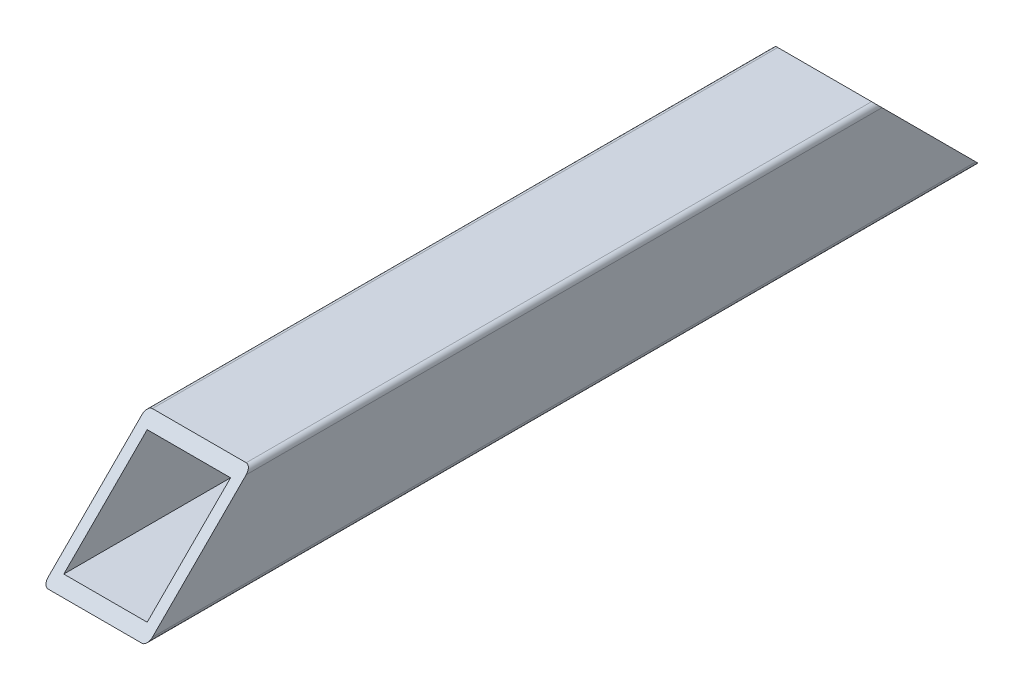
ISO-10303-21;
HEADER;
FILE_DESCRIPTION(('STEP AP214'),'2;1');
FILE_NAME('part.step','',(''),(''),'','','');
FILE_SCHEMA(('AUTOMOTIVE_DESIGN { 1 0 10303 214 1 1 1 1 }'));
ENDSEC;
DATA;
#1=APPLICATION_CONTEXT('core data for automotive mechanical design processes');
#2=APPLICATION_PROTOCOL_DEFINITION('international standard','automotive_design',2000,#1);
#3=PRODUCT_CONTEXT('',#1,'mechanical');
#4=PRODUCT('Part','Part','',(#3));
#5=PRODUCT_RELATED_PRODUCT_CATEGORY('part','',(#4));
#6=PRODUCT_DEFINITION_FORMATION('','',#4);
#7=PRODUCT_DEFINITION_CONTEXT('part definition',#1,'design');
#8=PRODUCT_DEFINITION('design','',#6,#7);
#9=PRODUCT_DEFINITION_SHAPE('','',#8);
#10=(LENGTH_UNIT() NAMED_UNIT(*) SI_UNIT(.MILLI.,.METRE.));
#11=(NAMED_UNIT(*) PLANE_ANGLE_UNIT() SI_UNIT($,.RADIAN.));
#12=(NAMED_UNIT(*) SI_UNIT($,.STERADIAN.) SOLID_ANGLE_UNIT());
#13=UNCERTAINTY_MEASURE_WITH_UNIT(LENGTH_MEASURE(1.E-05),#10,'distance_accuracy_value','');
#14=(GEOMETRIC_REPRESENTATION_CONTEXT(3) GLOBAL_UNCERTAINTY_ASSIGNED_CONTEXT((#13)) GLOBAL_UNIT_ASSIGNED_CONTEXT((#10,
#11,#12)) REPRESENTATION_CONTEXT('',''));
#15=CARTESIAN_POINT('',(0.,0.,0.));
#16=DIRECTION('',(0.,0.,1.));
#17=DIRECTION('',(1.,0.,0.));
#18=AXIS2_PLACEMENT_3D('',#15,#16,#17);
#19=CARTESIAN_POINT('',(-5.,-4.50000000000001,-80.));
#20=DIRECTION('',(1.,0.,0.));
#21=DIRECTION('',(0.,0.,-1.));
#22=AXIS2_PLACEMENT_3D('',#19,#20,#21);
#23=PLANE('',#22);
#24=DIRECTION('',(0.,0.,1.));
#25=VECTOR('',#24,1.);
#26=CARTESIAN_POINT('',(-5.,-4.50000000000001,-80.));
#27=LINE('',#26,#25);
#28=CARTESIAN_POINT('',(-5.,-4.50000000000001,-79.5));
#29=VERTEX_POINT('',#28);
#30=CARTESIAN_POINT('',(-5.,-4.5,-0.500000000000007));
#31=VERTEX_POINT('',#30);
#32=EDGE_CURVE('E212',#29,#31,#27,.T.);
#33=ORIENTED_EDGE('',*,*,#32,.T.);
#34=DIRECTION('',(0.,0.707106781186548,-0.707106781186547));
#35=VECTOR('',#34,1.);
#36=CARTESIAN_POINT('',(-5.,5.00000000000002,-10.));
#37=LINE('',#36,#35);
#38=CARTESIAN_POINT('',(-5.,4.50000000000001,-9.50000000000002));
#39=VERTEX_POINT('',#38);
#40=EDGE_CURVE('E179',#31,#39,#37,.T.);
#41=ORIENTED_EDGE('',*,*,#40,.T.);
#42=DIRECTION('',(0.,0.,1.));
#43=VECTOR('',#42,1.);
#44=CARTESIAN_POINT('',(-5.,4.50000000000001,-80.));
#45=LINE('',#44,#43);
#46=CARTESIAN_POINT('',(-5.,4.50000000000001,-70.5));
#47=VERTEX_POINT('',#46);
#48=EDGE_CURVE('E206',#47,#39,#45,.T.);
#49=ORIENTED_EDGE('',*,*,#48,.F.);
#50=DIRECTION('',(0.,-0.707106781186548,-0.707106781186547));
#51=VECTOR('',#50,1.);
#52=CARTESIAN_POINT('',(-5.,5.00000000000002,-70.));
#53=LINE('',#52,#51);
#54=EDGE_CURVE('E262',#47,#29,#53,.T.);
#55=ORIENTED_EDGE('',*,*,#54,.T.);
#56=EDGE_LOOP('',(#33,#41,#49,#55));
#57=FACE_BOUND('',#56,.T.);
#58=ADVANCED_FACE('F67',(#57),#23,.F.);
#59=CARTESIAN_POINT('',(-4.5,-5.00000000000001,-80.));
#60=DIRECTION('',(0.,1.,0.));
#61=DIRECTION('',(-1.,0.,0.));
#62=AXIS2_PLACEMENT_3D('',#59,#60,#61);
#63=PLANE('',#62);
#64=DIRECTION('',(-1.,0.,0.));
#65=VECTOR('',#64,1.);
#66=CARTESIAN_POINT('',(-4.5,-5.00000000000001,0.));
#67=LINE('',#66,#65);
#68=CARTESIAN_POINT('',(4.5,-5.00000000000001,0.));
#69=VERTEX_POINT('',#68);
#70=CARTESIAN_POINT('',(-4.5,-5.00000000000001,0.));
#71=VERTEX_POINT('',#70);
#72=EDGE_CURVE('E163',#69,#71,#67,.T.);
#73=ORIENTED_EDGE('',*,*,#72,.T.);
#74=DIRECTION('',(0.,0.,1.));
#75=VECTOR('',#74,1.);
#76=CARTESIAN_POINT('',(-4.5,-5.00000000000001,-80.));
#77=LINE('',#76,#75);
#78=CARTESIAN_POINT('',(-4.5,-5.00000000000001,-80.));
#79=VERTEX_POINT('',#78);
#80=EDGE_CURVE('E188',#79,#71,#77,.T.);
#81=ORIENTED_EDGE('',*,*,#80,.F.);
#82=DIRECTION('',(-1.,0.,0.));
#83=VECTOR('',#82,1.);
#84=CARTESIAN_POINT('',(-4.5,-5.00000000000001,-80.));
#85=LINE('',#84,#83);
#86=CARTESIAN_POINT('',(4.5,-5.00000000000001,-80.));
#87=VERTEX_POINT('',#86);
#88=EDGE_CURVE('E198',#87,#79,#85,.T.);
#89=ORIENTED_EDGE('',*,*,#88,.F.);
#90=DIRECTION('',(0.,0.,1.));
#91=VECTOR('',#90,1.);
#92=CARTESIAN_POINT('',(4.5,-5.00000000000001,-80.));
#93=LINE('',#92,#91);
#94=EDGE_CURVE('E185',#87,#69,#93,.T.);
#95=ORIENTED_EDGE('',*,*,#94,.T.);
#96=EDGE_LOOP('',(#73,#81,#89,#95));
#97=FACE_BOUND('',#96,.T.);
#98=ADVANCED_FACE('F232',(#97),#63,.F.);
#99=CARTESIAN_POINT('',(-4.5,-4.50000000000001,-80.));
#100=DIRECTION('',(0.,0.,1.));
#101=DIRECTION('',(1.,0.,0.));
#102=AXIS2_PLACEMENT_3D('',#99,#100,#101);
#103=CYLINDRICAL_SURFACE('',#102,0.500000000000002);
#104=ORIENTED_EDGE('',*,*,#80,.T.);
#105=CARTESIAN_POINT('',(-4.5,-4.50000000000001,-0.5));
#106=DIRECTION('',(0.,-0.707106781186547,-0.707106781186548));
#107=DIRECTION('',(0.,-0.707106781186548,0.707106781186547));
#108=AXIS2_PLACEMENT_3D('',#105,#106,#107);
#109=ELLIPSE('',#108,0.70710678118655,0.500000000000002);
#110=EDGE_CURVE('E169',#71,#31,#109,.T.);
#111=ORIENTED_EDGE('',*,*,#110,.T.);
#112=ORIENTED_EDGE('',*,*,#32,.F.);
#113=CARTESIAN_POINT('',(-4.5,-4.50000000000001,-79.5));
#114=DIRECTION('',(0.,-0.707106781186547,0.707106781186548));
#115=DIRECTION('',(0.,0.707106781186548,0.707106781186547));
#116=AXIS2_PLACEMENT_3D('',#113,#114,#115);
#117=ELLIPSE('',#116,0.70710678118655,0.500000000000002);
#118=EDGE_CURVE('E229',#29,#79,#117,.T.);
#119=ORIENTED_EDGE('',*,*,#118,.T.);
#120=EDGE_LOOP('',(#104,#111,#112,#119));
#121=FACE_BOUND('',#120,.T.);
#122=ADVANCED_FACE('F227',(#121),#103,.T.);
#123=CARTESIAN_POINT('',(4.5,-4.50000000000001,-80.));
#124=DIRECTION('',(0.,0.,1.));
#125=DIRECTION('',(1.,0.,0.));
#126=AXIS2_PLACEMENT_3D('',#123,#124,#125);
#127=CYLINDRICAL_SURFACE('',#126,0.500000000000002);
#128=DIRECTION('',(0.,0.,1.));
#129=VECTOR('',#128,1.);
#130=CARTESIAN_POINT('',(5.,-4.50000000000001,-80.));
#131=LINE('',#130,#129);
#132=CARTESIAN_POINT('',(5.,-4.50000000000001,-79.5));
#133=VERTEX_POINT('',#132);
#134=CARTESIAN_POINT('',(5.,-4.50000000000001,-0.500000000000002));
#135=VERTEX_POINT('',#134);
#136=EDGE_CURVE('E176',#133,#135,#131,.T.);
#137=ORIENTED_EDGE('',*,*,#136,.T.);
#138=CARTESIAN_POINT('',(4.5,-4.50000000000001,-0.5));
#139=DIRECTION('',(0.,-0.707106781186547,-0.707106781186548));
#140=DIRECTION('',(0.,-0.707106781186548,0.707106781186547));
#141=AXIS2_PLACEMENT_3D('',#138,#139,#140);
#142=ELLIPSE('',#141,0.70710678118655,0.500000000000002);
#143=EDGE_CURVE('E157',#135,#69,#142,.T.);
#144=ORIENTED_EDGE('',*,*,#143,.T.);
#145=ORIENTED_EDGE('',*,*,#94,.F.);
#146=CARTESIAN_POINT('',(4.5,-4.50000000000001,-79.5));
#147=DIRECTION('',(0.,-0.707106781186547,0.707106781186548));
#148=DIRECTION('',(0.,0.707106781186548,0.707106781186547));
#149=AXIS2_PLACEMENT_3D('',#146,#147,#148);
#150=ELLIPSE('',#149,0.70710678118655,0.500000000000002);
#151=EDGE_CURVE('E184',#87,#133,#150,.T.);
#152=ORIENTED_EDGE('',*,*,#151,.T.);
#153=EDGE_LOOP('',(#137,#144,#145,#152));
#154=FACE_BOUND('',#153,.T.);
#155=ADVANCED_FACE('F183',(#154),#127,.T.);
#156=CARTESIAN_POINT('',(5.,-4.50000000000001,-80.));
#157=DIRECTION('',(-1.,0.,0.));
#158=DIRECTION('',(0.,0.,1.));
#159=AXIS2_PLACEMENT_3D('',#156,#157,#158);
#160=PLANE('',#159);
#161=DIRECTION('',(0.,0.,1.));
#162=VECTOR('',#161,1.);
#163=CARTESIAN_POINT('',(5.,4.50000000000001,-80.));
#164=LINE('',#163,#162);
#165=CARTESIAN_POINT('',(5.,4.50000000000001,-70.5));
#166=VERTEX_POINT('',#165);
#167=CARTESIAN_POINT('',(5.,4.50000000000001,-9.50000000000002));
#168=VERTEX_POINT('',#167);
#169=EDGE_CURVE('E178',#166,#168,#164,.T.);
#170=ORIENTED_EDGE('',*,*,#169,.T.);
#171=DIRECTION('',(0.,0.707106781186548,-0.707106781186547));
#172=VECTOR('',#171,1.);
#173=CARTESIAN_POINT('',(5.,5.00000000000002,-10.));
#174=LINE('',#173,#172);
#175=EDGE_CURVE('E160',#135,#168,#174,.T.);
#176=ORIENTED_EDGE('',*,*,#175,.F.);
#177=ORIENTED_EDGE('',*,*,#136,.F.);
#178=DIRECTION('',(0.,-0.707106781186548,-0.707106781186547));
#179=VECTOR('',#178,1.);
#180=CARTESIAN_POINT('',(5.,5.00000000000002,-70.));
#181=LINE('',#180,#179);
#182=EDGE_CURVE('E263',#166,#133,#181,.T.);
#183=ORIENTED_EDGE('',*,*,#182,.F.);
#184=EDGE_LOOP('',(#170,#176,#177,#183));
#185=FACE_BOUND('',#184,.T.);
#186=ADVANCED_FACE('F174',(#185),#160,.F.);
#187=CARTESIAN_POINT('',(4.5,4.50000000000001,-80.));
#188=DIRECTION('',(0.,0.,1.));
#189=DIRECTION('',(1.,0.,0.));
#190=AXIS2_PLACEMENT_3D('',#187,#188,#189);
#191=CYLINDRICAL_SURFACE('',#190,0.500000000000002);
#192=DIRECTION('',(0.,0.,1.));
#193=VECTOR('',#192,1.);
#194=CARTESIAN_POINT('',(4.5,5.00000000000002,-80.));
#195=LINE('',#194,#193);
#196=CARTESIAN_POINT('',(4.5,5.00000000000002,-70.));
#197=VERTEX_POINT('',#196);
#198=CARTESIAN_POINT('',(4.5,5.00000000000002,-10.));
#199=VERTEX_POINT('',#198);
#200=EDGE_CURVE('E76',#197,#199,#195,.T.);
#201=ORIENTED_EDGE('',*,*,#200,.T.);
#202=CARTESIAN_POINT('',(4.5,4.50000000000001,-9.50000000000002));
#203=DIRECTION('',(0.,-0.707106781186547,-0.707106781186548));
#204=DIRECTION('',(0.,-0.707106781186548,0.707106781186547));
#205=AXIS2_PLACEMENT_3D('',#202,#203,#204);
#206=ELLIPSE('',#205,0.70710678118655,0.500000000000002);
#207=EDGE_CURVE('E168',#199,#168,#206,.T.);
#208=ORIENTED_EDGE('',*,*,#207,.T.);
#209=ORIENTED_EDGE('',*,*,#169,.F.);
#210=CARTESIAN_POINT('',(4.5,4.50000000000001,-70.5));
#211=DIRECTION('',(0.,-0.707106781186547,0.707106781186548));
#212=DIRECTION('',(0.,0.707106781186548,0.707106781186547));
#213=AXIS2_PLACEMENT_3D('',#210,#211,#212);
#214=ELLIPSE('',#213,0.70710678118655,0.500000000000002);
#215=EDGE_CURVE('E234',#166,#197,#214,.T.);
#216=ORIENTED_EDGE('',*,*,#215,.T.);
#217=EDGE_LOOP('',(#201,#208,#209,#216));
#218=FACE_BOUND('',#217,.T.);
#219=ADVANCED_FACE('F279',(#218),#191,.T.);
#220=CARTESIAN_POINT('',(-4.5,5.00000000000001,-80.));
#221=DIRECTION('',(0.,-1.,0.));
#222=DIRECTION('',(0.,0.,-1.));
#223=AXIS2_PLACEMENT_3D('',#220,#221,#222);
#224=PLANE('',#223);
#225=DIRECTION('',(0.,0.,1.));
#226=VECTOR('',#225,1.);
#227=CARTESIAN_POINT('',(-4.5,5.00000000000001,-80.));
#228=LINE('',#227,#226);
#229=CARTESIAN_POINT('',(-4.5,5.00000000000002,-70.));
#230=VERTEX_POINT('',#229);
#231=CARTESIAN_POINT('',(-4.5,5.00000000000002,-10.));
#232=VERTEX_POINT('',#231);
#233=EDGE_CURVE('E12',#230,#232,#228,.T.);
#234=ORIENTED_EDGE('',*,*,#233,.T.);
#235=DIRECTION('',(1.,0.,0.));
#236=VECTOR('',#235,1.);
#237=CARTESIAN_POINT('',(-5.,5.00000000000002,-10.));
#238=LINE('',#237,#236);
#239=EDGE_CURVE('E260',#232,#199,#238,.T.);
#240=ORIENTED_EDGE('',*,*,#239,.T.);
#241=ORIENTED_EDGE('',*,*,#200,.F.);
#242=DIRECTION('',(1.,0.,0.));
#243=VECTOR('',#242,1.);
#244=CARTESIAN_POINT('',(-5.,5.00000000000002,-70.));
#245=LINE('',#244,#243);
#246=EDGE_CURVE('E180',#230,#197,#245,.T.);
#247=ORIENTED_EDGE('',*,*,#246,.F.);
#248=EDGE_LOOP('',(#234,#240,#241,#247));
#249=FACE_BOUND('',#248,.T.);
#250=ADVANCED_FACE('F274',(#249),#224,.F.);
#251=CARTESIAN_POINT('',(-4.5,4.50000000000001,-80.));
#252=DIRECTION('',(0.,0.,1.));
#253=DIRECTION('',(1.,0.,0.));
#254=AXIS2_PLACEMENT_3D('',#251,#252,#253);
#255=CYLINDRICAL_SURFACE('',#254,0.500000000000002);
#256=ORIENTED_EDGE('',*,*,#48,.T.);
#257=CARTESIAN_POINT('',(-4.5,4.50000000000001,-9.50000000000002));
#258=DIRECTION('',(0.,-0.707106781186547,-0.707106781186548));
#259=DIRECTION('',(0.,-0.707106781186548,0.707106781186547));
#260=AXIS2_PLACEMENT_3D('',#257,#258,#259);
#261=ELLIPSE('',#260,0.70710678118655,0.500000000000002);
#262=EDGE_CURVE('E249',#39,#232,#261,.T.);
#263=ORIENTED_EDGE('',*,*,#262,.T.);
#264=ORIENTED_EDGE('',*,*,#233,.F.);
#265=CARTESIAN_POINT('',(-4.5,4.50000000000001,-70.5));
#266=DIRECTION('',(0.,-0.707106781186547,0.707106781186548));
#267=DIRECTION('',(0.,0.707106781186548,0.707106781186547));
#268=AXIS2_PLACEMENT_3D('',#265,#266,#267);
#269=ELLIPSE('',#268,0.70710678118655,0.500000000000002);
#270=EDGE_CURVE('E233',#230,#47,#269,.T.);
#271=ORIENTED_EDGE('',*,*,#270,.T.);
#272=EDGE_LOOP('',(#256,#263,#264,#271));
#273=FACE_BOUND('',#272,.T.);
#274=ADVANCED_FACE('F271',(#273),#255,.T.);
#275=CARTESIAN_POINT('',(-5.,5.00000000000002,-10.));
#276=DIRECTION('',(0.,-0.707106781186547,-0.707106781186548));
#277=DIRECTION('',(0.,0.707106781186548,-0.707106781186547));
#278=AXIS2_PLACEMENT_3D('',#275,#276,#277);
#279=PLANE('',#278);
#280=DIRECTION('',(0.,0.707106781186548,-0.707106781186547));
#281=VECTOR('',#280,1.);
#282=CARTESIAN_POINT('',(-4.,35.5,-40.5));
#283=LINE('',#282,#281);
#284=CARTESIAN_POINT('',(-4.,-4.,-1.));
#285=VERTEX_POINT('',#284);
#286=CARTESIAN_POINT('',(-4.,4.00000000000001,-9.00000000000001));
#287=VERTEX_POINT('',#286);
#288=EDGE_CURVE('E92',#285,#287,#283,.T.);
#289=ORIENTED_EDGE('',*,*,#288,.T.);
#290=DIRECTION('',(1.,0.,0.));
#291=VECTOR('',#290,1.);
#292=CARTESIAN_POINT('',(-4.,4.00000000000001,-9.00000000000001));
#293=LINE('',#292,#291);
#294=CARTESIAN_POINT('',(4.,4.00000000000001,-9.00000000000001));
#295=VERTEX_POINT('',#294);
#296=EDGE_CURVE('E258',#287,#295,#293,.T.);
#297=ORIENTED_EDGE('',*,*,#296,.T.);
#298=DIRECTION('',(0.,-0.707106781186548,0.707106781186547));
#299=VECTOR('',#298,1.);
#300=CARTESIAN_POINT('',(4.,35.5,-40.5));
#301=LINE('',#300,#299);
#302=CARTESIAN_POINT('',(4.,-4.,-1.00000000000001));
#303=VERTEX_POINT('',#302);
#304=EDGE_CURVE('E256',#295,#303,#301,.T.);
#305=ORIENTED_EDGE('',*,*,#304,.T.);
#306=DIRECTION('',(-1.,0.,0.));
#307=VECTOR('',#306,1.);
#308=CARTESIAN_POINT('',(-4.,-4.,-1.));
#309=LINE('',#308,#307);
#310=EDGE_CURVE('E254',#303,#285,#309,.T.);
#311=ORIENTED_EDGE('',*,*,#310,.T.);
#312=EDGE_LOOP('',(#289,#297,#305,#311));
#313=FACE_BOUND('',#312,.T.);
#314=ORIENTED_EDGE('',*,*,#40,.F.);
#315=ORIENTED_EDGE('',*,*,#110,.F.);
#316=ORIENTED_EDGE('',*,*,#72,.F.);
#317=ORIENTED_EDGE('',*,*,#143,.F.);
#318=ORIENTED_EDGE('',*,*,#175,.T.);
#319=ORIENTED_EDGE('',*,*,#207,.F.);
#320=ORIENTED_EDGE('',*,*,#239,.F.);
#321=ORIENTED_EDGE('',*,*,#262,.F.);
#322=EDGE_LOOP('',(#314,#315,#316,#317,#318,#319,#320,#321));
#323=FACE_BOUND('',#322,.T.);
#324=ADVANCED_FACE('F159',(#313,#323),#279,.F.);
#325=CARTESIAN_POINT('',(-5.,5.00000000000002,-70.));
#326=DIRECTION('',(0.,-0.707106781186547,0.707106781186548));
#327=DIRECTION('',(0.,-0.707106781186548,-0.707106781186547));
#328=AXIS2_PLACEMENT_3D('',#325,#326,#327);
#329=PLANE('',#328);
#330=DIRECTION('',(0.,-0.707106781186548,-0.707106781186547));
#331=VECTOR('',#330,1.);
#332=CARTESIAN_POINT('',(-4.,-4.50000000000001,-79.5));
#333=LINE('',#332,#331);
#334=CARTESIAN_POINT('',(-4.,4.00000000000001,-71.));
#335=VERTEX_POINT('',#334);
#336=CARTESIAN_POINT('',(-4.,-4.,-79.));
#337=VERTEX_POINT('',#336);
#338=EDGE_CURVE('E242',#335,#337,#333,.T.);
#339=ORIENTED_EDGE('',*,*,#338,.T.);
#340=DIRECTION('',(1.,0.,0.));
#341=VECTOR('',#340,1.);
#342=CARTESIAN_POINT('',(-4.,-4.,-79.));
#343=LINE('',#342,#341);
#344=CARTESIAN_POINT('',(4.,-4.,-79.));
#345=VERTEX_POINT('',#344);
#346=EDGE_CURVE('E244',#337,#345,#343,.T.);
#347=ORIENTED_EDGE('',*,*,#346,.T.);
#348=DIRECTION('',(0.,0.707106781186548,0.707106781186547));
#349=VECTOR('',#348,1.);
#350=CARTESIAN_POINT('',(4.,-4.50000000000001,-79.5));
#351=LINE('',#350,#349);
#352=CARTESIAN_POINT('',(4.,4.00000000000001,-71.));
#353=VERTEX_POINT('',#352);
#354=EDGE_CURVE('E84',#345,#353,#351,.T.);
#355=ORIENTED_EDGE('',*,*,#354,.T.);
#356=DIRECTION('',(-1.,0.,0.));
#357=VECTOR('',#356,1.);
#358=CARTESIAN_POINT('',(-4.,4.00000000000001,-71.));
#359=LINE('',#358,#357);
#360=EDGE_CURVE('E247',#353,#335,#359,.T.);
#361=ORIENTED_EDGE('',*,*,#360,.T.);
#362=EDGE_LOOP('',(#339,#347,#355,#361));
#363=FACE_BOUND('',#362,.T.);
#364=ORIENTED_EDGE('',*,*,#246,.T.);
#365=ORIENTED_EDGE('',*,*,#215,.F.);
#366=ORIENTED_EDGE('',*,*,#182,.T.);
#367=ORIENTED_EDGE('',*,*,#151,.F.);
#368=ORIENTED_EDGE('',*,*,#88,.T.);
#369=ORIENTED_EDGE('',*,*,#118,.F.);
#370=ORIENTED_EDGE('',*,*,#54,.F.);
#371=ORIENTED_EDGE('',*,*,#270,.F.);
#372=EDGE_LOOP('',(#364,#365,#366,#367,#368,#369,#370,#371));
#373=FACE_BOUND('',#372,.T.);
#374=ADVANCED_FACE('F277',(#363,#373),#329,.F.);
#375=CARTESIAN_POINT('',(-4.,-4.,-80.));
#376=DIRECTION('',(1.,0.,0.));
#377=DIRECTION('',(0.,0.,-1.));
#378=AXIS2_PLACEMENT_3D('',#375,#376,#377);
#379=PLANE('',#378);
#380=ORIENTED_EDGE('',*,*,#288,.F.);
#381=DIRECTION('',(0.,0.,1.));
#382=VECTOR('',#381,1.);
#383=CARTESIAN_POINT('',(-4.,-4.,-80.));
#384=LINE('',#383,#382);
#385=EDGE_CURVE('E71',#337,#285,#384,.T.);
#386=ORIENTED_EDGE('',*,*,#385,.F.);
#387=ORIENTED_EDGE('',*,*,#338,.F.);
#388=DIRECTION('',(0.,0.,1.));
#389=VECTOR('',#388,1.);
#390=CARTESIAN_POINT('',(-4.,4.00000000000001,-80.));
#391=LINE('',#390,#389);
#392=EDGE_CURVE('E194',#335,#287,#391,.T.);
#393=ORIENTED_EDGE('',*,*,#392,.T.);
#394=EDGE_LOOP('',(#380,#386,#387,#393));
#395=FACE_BOUND('',#394,.T.);
#396=ADVANCED_FACE('F69',(#395),#379,.T.);
#397=CARTESIAN_POINT('',(-4.,-4.,-80.));
#398=DIRECTION('',(0.,1.,0.));
#399=DIRECTION('',(0.,0.,1.));
#400=AXIS2_PLACEMENT_3D('',#397,#398,#399);
#401=PLANE('',#400);
#402=ORIENTED_EDGE('',*,*,#310,.F.);
#403=DIRECTION('',(0.,0.,1.));
#404=VECTOR('',#403,1.);
#405=CARTESIAN_POINT('',(4.,-4.,-80.));
#406=LINE('',#405,#404);
#407=EDGE_CURVE('E200',#345,#303,#406,.T.);
#408=ORIENTED_EDGE('',*,*,#407,.F.);
#409=ORIENTED_EDGE('',*,*,#346,.F.);
#410=ORIENTED_EDGE('',*,*,#385,.T.);
#411=EDGE_LOOP('',(#402,#408,#409,#410));
#412=FACE_BOUND('',#411,.T.);
#413=ADVANCED_FACE('F347',(#412),#401,.T.);
#414=CARTESIAN_POINT('',(4.,-4.,-80.));
#415=DIRECTION('',(-1.,0.,0.));
#416=DIRECTION('',(0.,0.,1.));
#417=AXIS2_PLACEMENT_3D('',#414,#415,#416);
#418=PLANE('',#417);
#419=ORIENTED_EDGE('',*,*,#304,.F.);
#420=DIRECTION('',(0.,0.,1.));
#421=VECTOR('',#420,1.);
#422=CARTESIAN_POINT('',(4.,4.00000000000001,-80.));
#423=LINE('',#422,#421);
#424=EDGE_CURVE('E197',#353,#295,#423,.T.);
#425=ORIENTED_EDGE('',*,*,#424,.F.);
#426=ORIENTED_EDGE('',*,*,#354,.F.);
#427=ORIENTED_EDGE('',*,*,#407,.T.);
#428=EDGE_LOOP('',(#419,#425,#426,#427));
#429=FACE_BOUND('',#428,.T.);
#430=ADVANCED_FACE('F355',(#429),#418,.T.);
#431=CARTESIAN_POINT('',(-4.,4.00000000000001,-80.));
#432=DIRECTION('',(0.,-1.,0.));
#433=DIRECTION('',(0.,0.,-1.));
#434=AXIS2_PLACEMENT_3D('',#431,#432,#433);
#435=PLANE('',#434);
#436=ORIENTED_EDGE('',*,*,#296,.F.);
#437=ORIENTED_EDGE('',*,*,#392,.F.);
#438=ORIENTED_EDGE('',*,*,#360,.F.);
#439=ORIENTED_EDGE('',*,*,#424,.T.);
#440=EDGE_LOOP('',(#436,#437,#438,#439));
#441=FACE_BOUND('',#440,.T.);
#442=ADVANCED_FACE('F362',(#441),#435,.T.);
#443=CLOSED_SHELL('',(#58,#98,#122,#155,#186,#219,#250,#274,#324,#374,#396,#413,#430,#442));
#444=MANIFOLD_SOLID_BREP('B2',#443);
#445=ADVANCED_BREP_SHAPE_REPRESENTATION('',(#18,#444),#14);
#446=SHAPE_DEFINITION_REPRESENTATION(#9,#445);
ENDSEC;
END-ISO-10303-21;
